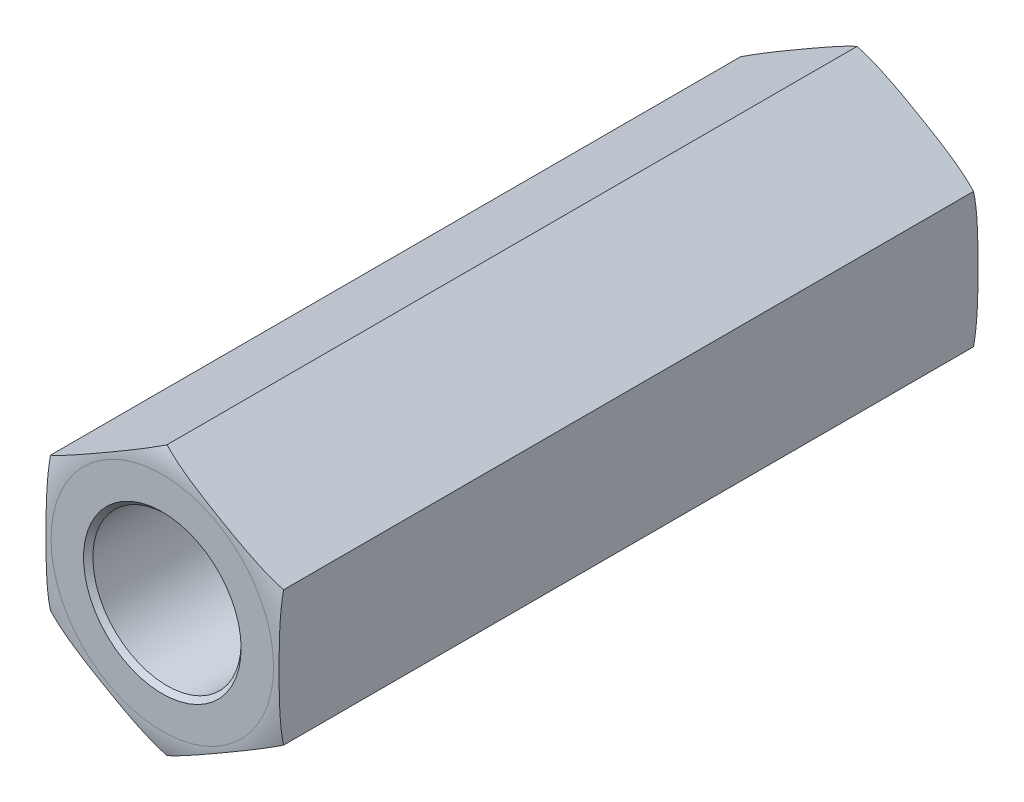
ISO-10303-21;
HEADER;
FILE_DESCRIPTION(('STEP AP214'),'2;1');
FILE_NAME('part.step','',(''),(''),'','','');
FILE_SCHEMA(('AUTOMOTIVE_DESIGN { 1 0 10303 214 1 1 1 1 }'));
ENDSEC;
DATA;
#1=APPLICATION_CONTEXT('core data for automotive mechanical design processes');
#2=APPLICATION_PROTOCOL_DEFINITION('international standard','automotive_design',2000,#1);
#3=PRODUCT_CONTEXT('',#1,'mechanical');
#4=PRODUCT('Part','Part','',(#3));
#5=PRODUCT_RELATED_PRODUCT_CATEGORY('part','',(#4));
#6=PRODUCT_DEFINITION_FORMATION('','',#4);
#7=PRODUCT_DEFINITION_CONTEXT('part definition',#1,'design');
#8=PRODUCT_DEFINITION('design','',#6,#7);
#9=PRODUCT_DEFINITION_SHAPE('','',#8);
#10=(LENGTH_UNIT() NAMED_UNIT(*) SI_UNIT(.MILLI.,.METRE.));
#11=(NAMED_UNIT(*) PLANE_ANGLE_UNIT() SI_UNIT($,.RADIAN.));
#12=(NAMED_UNIT(*) SI_UNIT($,.STERADIAN.) SOLID_ANGLE_UNIT());
#13=UNCERTAINTY_MEASURE_WITH_UNIT(LENGTH_MEASURE(1.E-05),#10,'distance_accuracy_value','');
#14=(GEOMETRIC_REPRESENTATION_CONTEXT(3) GLOBAL_UNCERTAINTY_ASSIGNED_CONTEXT((#13)) GLOBAL_UNIT_ASSIGNED_CONTEXT((#10,
#11,#12)) REPRESENTATION_CONTEXT('',''));
#15=CARTESIAN_POINT('',(0.,0.,0.));
#16=DIRECTION('',(0.,0.,1.));
#17=DIRECTION('',(1.,0.,0.));
#18=AXIS2_PLACEMENT_3D('',#15,#16,#17);
#19=CARTESIAN_POINT('',(0.,-3.66617420935413,9.525));
#20=DIRECTION('',(-0.5,0.866025403784439,0.));
#21=DIRECTION('',(-0.866025403784439,-0.5,0.));
#22=AXIS2_PLACEMENT_3D('',#19,#20,#21);
#23=PLANE('',#22);
#24=CARTESIAN_POINT('',(3.175,-1.83308710467706,-9.398));
#25=CARTESIAN_POINT('',(3.10884502143944,-1.87128169935724,-9.41390141489969));
#26=CARTESIAN_POINT('',(3.04231434139612,-1.90969320538961,-9.4274886076105));
#27=CARTESIAN_POINT('',(2.90881203820564,-1.98677079607408,-9.45081619794021));
#28=CARTESIAN_POINT('',(2.8418409298126,-2.02543658353272,-9.46056047713974));
#29=CARTESIAN_POINT('',(2.70776562760761,-2.10284499535246,-9.4769966530451));
#30=CARTESIAN_POINT('',(2.6406619569018,-2.14158731769806,-9.48369453286691));
#31=CARTESIAN_POINT('',(2.506296989443,-2.21916296783006,-9.4947767572932));
#32=CARTESIAN_POINT('',(2.43903565365471,-2.25799631815348,-9.49916045047396));
#33=CARTESIAN_POINT('',(2.30441315431188,-2.33572065438805,-9.50624030042628));
#34=CARTESIAN_POINT('',(2.23705195613841,-2.37461166028644,-9.50893552375912));
#35=CARTESIAN_POINT('',(2.10230150749303,-2.45240986808527,-9.51315319837134));
#36=CARTESIAN_POINT('',(2.03491225611042,-2.49131707051151,-9.51467560802717));
#37=CARTESIAN_POINT('',(1.90080117716411,-2.56874613804247,-9.51692270588903));
#38=CARTESIAN_POINT('',(1.83407943898347,-2.60726795154186,-9.51765524681808));
#39=CARTESIAN_POINT('',(1.70063258160857,-2.68431353056977,-9.51857673025741));
#40=CARTESIAN_POINT('',(1.63390746238221,-2.72283729611682,-9.5187656658949));
#41=CARTESIAN_POINT('',(1.50042805184615,-2.79990166972109,-9.51866599668056));
#42=CARTESIAN_POINT('',(1.43367376064956,-2.838442277713,-9.51837718117656));
#43=CARTESIAN_POINT('',(1.30016736153918,-2.91552223317792,-9.517221986219));
#44=CARTESIAN_POINT('',(1.23341525368108,-2.95406158061876,-9.51635559703857));
#45=CARTESIAN_POINT('',(1.09992603365712,-3.03113161773351,-9.51378619406563));
#46=CARTESIAN_POINT('',(1.03318892086051,-3.06966230777157,-9.51208322716165));
#47=CARTESIAN_POINT('',(0.899747408901568,-3.14670480062214,-9.5074387229726));
#48=CARTESIAN_POINT('',(0.83304300828058,-3.1852166042768,-9.5044972471358));
#49=CARTESIAN_POINT('',(0.723572811888899,-3.24841925163177,-9.49821741247488));
#50=CARTESIAN_POINT('',(0.680784975201788,-3.27312282066112,-9.49539801104632));
#51=CARTESIAN_POINT('',(0.595275288478836,-3.32249186130894,-9.48886967943036));
#52=CARTESIAN_POINT('',(0.552553419802716,-3.34715734368938,-9.4851610809139));
#53=CARTESIAN_POINT('',(0.467204135573515,-3.39643377591425,-9.47668027114969));
#54=CARTESIAN_POINT('',(0.424576690233944,-3.42104474295592,-9.47190846570084));
#55=CARTESIAN_POINT('',(0.339332728524412,-3.47026036719571,-9.46109877125159));
#56=CARTESIAN_POINT('',(0.296716508711445,-3.49486485317657,-9.45505773130842));
#57=CARTESIAN_POINT('',(0.211632627284932,-3.54398805502186,-9.44151383541612));
#58=CARTESIAN_POINT('',(0.169165057524195,-3.56850671785505,-9.43401019780296));
#59=CARTESIAN_POINT('',(0.0844105764825441,-3.61743974029948,-9.41732035070844));
#60=CARTESIAN_POINT('',(0.0421240573590994,-3.64185387349849,-9.40813149780328));
#61=CARTESIAN_POINT('',(0.,-3.66617420935412,-9.398));
#62=B_SPLINE_CURVE_WITH_KNOTS('',3,(#24,#25,#26,#27,#28,#29,#30,#31,#32,#33,#34,#35,#36,#37,#38,
#39,#40,#41,#42,#43,#44,#45,#46,#47,#48,#49,#50,#51,#52,#53,#54,#55,#56,#57,#58,#59,#60,#61),
.UNSPECIFIED.,.F.,.F.,(4,2,2,2,2,2,2,2,2,2,2,2,2,2,2,2,2,2,4),(0.,0.233977307817948,
0.467717675040706,0.700996973557518,0.934341903229774,1.16781571967243,1.40129782179828,
1.63243665809674,1.86357841666622,2.094822118463,2.32606971471501,2.55730435147404,
2.7885275169442,2.93698369265093,3.08538458004479,3.23372892334588,3.38244598546615,
3.53124274626086,3.68027493713585),.UNSPECIFIED.);
#63=CARTESIAN_POINT('',(3.175,-1.83308710467706,-9.39799999999999));
#64=VERTEX_POINT('',#63);
#65=CARTESIAN_POINT('',(0.,-3.66617420935413,-9.398));
#66=VERTEX_POINT('',#65);
#67=EDGE_CURVE('E99',#64,#66,#62,.T.);
#68=ORIENTED_EDGE('',*,*,#67,.F.);
#69=DIRECTION('',(0.,0.,1.));
#70=VECTOR('',#69,1.);
#71=CARTESIAN_POINT('',(3.175,-1.83308710467706,9.525));
#72=LINE('',#71,#70);
#73=CARTESIAN_POINT('',(3.175,-1.83308710467706,9.398));
#74=VERTEX_POINT('',#73);
#75=EDGE_CURVE('E106',#64,#74,#72,.T.);
#76=ORIENTED_EDGE('',*,*,#75,.T.);
#77=CARTESIAN_POINT('',(0.,-3.66617420935413,9.398));
#78=CARTESIAN_POINT('',(0.0661549785605615,-3.62797961467395,9.41390141489968));
#79=CARTESIAN_POINT('',(0.13268565860388,-3.58956810864157,9.4274886076105));
#80=CARTESIAN_POINT('',(0.266187961794368,-3.51249051795711,9.45081619794021));
#81=CARTESIAN_POINT('',(0.333159070187402,-3.47382473049846,9.46056047713974));
#82=CARTESIAN_POINT('',(0.467234372392397,-3.39641631867873,9.4769966530451));
#83=CARTESIAN_POINT('',(0.534338043098203,-3.35767399633312,9.48369453286691));
#84=CARTESIAN_POINT('',(0.668703010557004,-3.28009834620112,9.4947767572932));
#85=CARTESIAN_POINT('',(0.735964346345294,-3.2412649958777,9.49916045047396));
#86=CARTESIAN_POINT('',(0.870586845688128,-3.16354065964314,9.50624030042628));
#87=CARTESIAN_POINT('',(0.937948043861601,-3.12464965374475,9.50893552375912));
#88=CARTESIAN_POINT('',(1.07269849250698,-3.04685144594591,9.51315319837134));
#89=CARTESIAN_POINT('',(1.14008774388959,-3.00794424351968,9.51467560802717));
#90=CARTESIAN_POINT('',(1.2741988228359,-2.93051517598871,9.51692270588903));
#91=CARTESIAN_POINT('',(1.34092056101654,-2.89199336248932,9.51765524681808));
#92=CARTESIAN_POINT('',(1.47436741839144,-2.81494778346141,9.51857673025741));
#93=CARTESIAN_POINT('',(1.5410925376178,-2.77642401791437,9.5187656658949));
#94=CARTESIAN_POINT('',(1.67457194815386,-2.6993596443101,9.51866599668056));
#95=CARTESIAN_POINT('',(1.74132623935045,-2.66081903631818,9.51837718117656));
#96=CARTESIAN_POINT('',(1.87483263846084,-2.58373908085327,9.517221986219));
#97=CARTESIAN_POINT('',(1.94158474631893,-2.54519973341242,9.51635559703857));
#98=CARTESIAN_POINT('',(2.07507396634289,-2.46812969629767,9.51378619406563));
#99=CARTESIAN_POINT('',(2.1418110791395,-2.42959900625961,9.51208322716165));
#100=CARTESIAN_POINT('',(2.27525259109844,-2.35255651340905,9.5074387229726));
#101=CARTESIAN_POINT('',(2.34195699171943,-2.31404470975438,9.5044972471358));
#102=CARTESIAN_POINT('',(2.45142718811111,-2.25084206239941,9.49821741247488));
#103=CARTESIAN_POINT('',(2.49421502479822,-2.22613849337006,9.49539801104632));
#104=CARTESIAN_POINT('',(2.57972471152117,-2.17676945272225,9.48886967943036));
#105=CARTESIAN_POINT('',(2.62244658019729,-2.15210397034181,9.4851610809139));
#106=CARTESIAN_POINT('',(2.70779586442649,-2.10282753811693,9.47668027114969));
#107=CARTESIAN_POINT('',(2.75042330976606,-2.07821657107527,9.47190846570084));
#108=CARTESIAN_POINT('',(2.83566727147559,-2.02900094683548,9.46109877125159));
#109=CARTESIAN_POINT('',(2.87828349128856,-2.00439646085462,9.45505773130842));
#110=CARTESIAN_POINT('',(2.96336737271507,-1.95527325900932,9.44151383541612));
#111=CARTESIAN_POINT('',(3.00583494247581,-1.93075459617613,9.43401019780296));
#112=CARTESIAN_POINT('',(3.09058942351746,-1.88182157373171,9.41732035070844));
#113=CARTESIAN_POINT('',(3.1328759426409,-1.8574074405327,9.40813149780329));
#114=CARTESIAN_POINT('',(3.175,-1.83308710467706,9.398));
#115=B_SPLINE_CURVE_WITH_KNOTS('',3,(#77,#78,#79,#80,#81,#82,#83,#84,#85,#86,#87,#88,#89,#90,
#91,#92,#93,#94,#95,#96,#97,#98,#99,#100,#101,#102,#103,#104,#105,#106,#107,#108,#109,#110,#111,
#112,#113,#114),.UNSPECIFIED.,.F.,.F.,(4,2,2,2,2,2,2,2,2,2,2,2,2,2,2,2,2,2,4),(0.,
0.233977307817948,0.467717675040707,0.700996973557521,0.934341903229778,1.16781571967243,
1.40129782179829,1.63243665809674,1.86357841666622,2.094822118463,2.32606971471502,
2.55730435147405,2.78852751694421,2.93698369265094,3.08538458004479,3.23372892334589,
3.38244598546615,3.53124274626085,3.68027493713585),.UNSPECIFIED.);
#116=CARTESIAN_POINT('',(0.,-3.66617420935413,9.398));
#117=VERTEX_POINT('',#116);
#118=EDGE_CURVE('E95',#117,#74,#115,.T.);
#119=ORIENTED_EDGE('',*,*,#118,.F.);
#120=DIRECTION('',(0.,0.,1.));
#121=VECTOR('',#120,1.);
#122=CARTESIAN_POINT('',(0.,-3.66617420935413,9.525));
#123=LINE('',#122,#121);
#124=EDGE_CURVE('E148',#117,#66,#123,.F.);
#125=ORIENTED_EDGE('',*,*,#124,.T.);
#126=EDGE_LOOP('',(#68,#76,#119,#125));
#127=FACE_BOUND('',#126,.T.);
#128=ADVANCED_FACE('F16',(#127),#23,.F.);
#129=CARTESIAN_POINT('',(-3.175,-1.83308710467706,9.525));
#130=DIRECTION('',(0.5,0.866025403784439,0.));
#131=DIRECTION('',(-0.866025403784439,0.5,0.));
#132=AXIS2_PLACEMENT_3D('',#129,#130,#131);
#133=PLANE('',#132);
#134=CARTESIAN_POINT('',(0.,-3.66617420935412,-9.398));
#135=CARTESIAN_POINT('',(-0.0661549785605632,-3.62797961467395,-9.41390141489968));
#136=CARTESIAN_POINT('',(-0.132685658603882,-3.58956810864157,-9.4274886076105));
#137=CARTESIAN_POINT('',(-0.26618796179437,-3.51249051795711,-9.45081619794021));
#138=CARTESIAN_POINT('',(-0.333159070187403,-3.47382473049846,-9.46056047713974));
#139=CARTESIAN_POINT('',(-0.467234372392398,-3.39641631867873,-9.4769966530451));
#140=CARTESIAN_POINT('',(-0.534338043098204,-3.35767399633312,-9.48369453286691));
#141=CARTESIAN_POINT('',(-0.668703010557005,-3.28009834620113,-9.4947767572932));
#142=CARTESIAN_POINT('',(-0.735964346345294,-3.2412649958777,-9.49916045047396));
#143=CARTESIAN_POINT('',(-0.870586845688129,-3.16354065964314,-9.50624030042628));
#144=CARTESIAN_POINT('',(-0.937948043861602,-3.12464965374475,-9.50893552375912));
#145=CARTESIAN_POINT('',(-1.07269849250698,-3.04685144594591,-9.51315319837134));
#146=CARTESIAN_POINT('',(-1.14008774388959,-3.00794424351968,-9.51467560802717));
#147=CARTESIAN_POINT('',(-1.2741988228359,-2.93051517598871,-9.51692270588903));
#148=CARTESIAN_POINT('',(-1.34092056101654,-2.89199336248932,-9.51765524681808));
#149=CARTESIAN_POINT('',(-1.47436741839144,-2.81494778346141,-9.51857673025741));
#150=CARTESIAN_POINT('',(-1.5410925376178,-2.77642401791437,-9.5187656658949));
#151=CARTESIAN_POINT('',(-1.67457194815386,-2.6993596443101,-9.51866599668056));
#152=CARTESIAN_POINT('',(-1.74132623935045,-2.66081903631818,-9.51837718117656));
#153=CARTESIAN_POINT('',(-1.87483263846083,-2.58373908085327,-9.517221986219));
#154=CARTESIAN_POINT('',(-1.94158474631893,-2.54519973341242,-9.51635559703857));
#155=CARTESIAN_POINT('',(-2.07507396634289,-2.46812969629767,-9.51378619406563));
#156=CARTESIAN_POINT('',(-2.1418110791395,-2.42959900625961,-9.51208322716165));
#157=CARTESIAN_POINT('',(-2.27525259109844,-2.35255651340905,-9.5074387229726));
#158=CARTESIAN_POINT('',(-2.34195699171943,-2.31404470975439,-9.5044972471358));
#159=CARTESIAN_POINT('',(-2.45142718811111,-2.25084206239941,-9.49821741247488));
#160=CARTESIAN_POINT('',(-2.49421502479822,-2.22613849337006,-9.49539801104632));
#161=CARTESIAN_POINT('',(-2.57972471152117,-2.17676945272225,-9.48886967943036));
#162=CARTESIAN_POINT('',(-2.62244658019729,-2.1521039703418,-9.4851610809139));
#163=CARTESIAN_POINT('',(-2.70779586442649,-2.10282753811693,-9.47668027114969));
#164=CARTESIAN_POINT('',(-2.75042330976606,-2.07821657107527,-9.47190846570084));
#165=CARTESIAN_POINT('',(-2.83566727147559,-2.02900094683548,-9.46109877125159));
#166=CARTESIAN_POINT('',(-2.87828349128856,-2.00439646085462,-9.45505773130842));
#167=CARTESIAN_POINT('',(-2.96336737271507,-1.95527325900932,-9.44151383541612));
#168=CARTESIAN_POINT('',(-3.00583494247581,-1.93075459617613,-9.43401019780296));
#169=CARTESIAN_POINT('',(-3.09058942351746,-1.88182157373171,-9.41732035070844));
#170=CARTESIAN_POINT('',(-3.1328759426409,-1.8574074405327,-9.40813149780329));
#171=CARTESIAN_POINT('',(-3.175,-1.83308710467706,-9.398));
#172=B_SPLINE_CURVE_WITH_KNOTS('',3,(#134,#135,#136,#137,#138,#139,#140,#141,#142,#143,#144,
#145,#146,#147,#148,#149,#150,#151,#152,#153,#154,#155,#156,#157,#158,#159,#160,#161,#162,#163,
#164,#165,#166,#167,#168,#169,#170,#171),.UNSPECIFIED.,.F.,.F.,(4,2,2,2,2,2,2,2,2,2,2,2,2,2,2,2,
2,2,4),(0.,0.233977307817948,0.467717675040707,0.70099697355752,0.934341903229777,
1.16781571967243,1.40129782179829,1.63243665809674,1.86357841666622,2.094822118463,
2.32606971471502,2.55730435147405,2.78852751694421,2.93698369265094,3.08538458004479,
3.23372892334589,3.38244598546615,3.53124274626085,3.68027493713585),.UNSPECIFIED.);
#173=CARTESIAN_POINT('',(-3.175,-1.83308710467706,-9.398));
#174=VERTEX_POINT('',#173);
#175=EDGE_CURVE('E248',#66,#174,#172,.T.);
#176=ORIENTED_EDGE('',*,*,#175,.F.);
#177=ORIENTED_EDGE('',*,*,#124,.F.);
#178=CARTESIAN_POINT('',(-3.175,-1.83308710467706,9.398));
#179=CARTESIAN_POINT('',(-3.10884502143944,-1.87128169935724,9.41390141489968));
#180=CARTESIAN_POINT('',(-3.04231434139612,-1.90969320538961,9.4274886076105));
#181=CARTESIAN_POINT('',(-2.90881203820563,-1.98677079607408,9.45081619794021));
#182=CARTESIAN_POINT('',(-2.8418409298126,-2.02543658353272,9.46056047713974));
#183=CARTESIAN_POINT('',(-2.70776562760761,-2.10284499535246,9.4769966530451));
#184=CARTESIAN_POINT('',(-2.6406619569018,-2.14158731769807,9.48369453286691));
#185=CARTESIAN_POINT('',(-2.506296989443,-2.21916296783006,9.4947767572932));
#186=CARTESIAN_POINT('',(-2.43903565365471,-2.25799631815348,9.49916045047396));
#187=CARTESIAN_POINT('',(-2.30441315431188,-2.33572065438805,9.50624030042628));
#188=CARTESIAN_POINT('',(-2.2370519561384,-2.37461166028644,9.50893552375912));
#189=CARTESIAN_POINT('',(-2.10230150749302,-2.45240986808527,9.51315319837134));
#190=CARTESIAN_POINT('',(-2.03491225611041,-2.49131707051151,9.51467560802717));
#191=CARTESIAN_POINT('',(-1.9008011771641,-2.56874613804247,9.51692270588903));
#192=CARTESIAN_POINT('',(-1.83407943898347,-2.60726795154186,9.51765524681808));
#193=CARTESIAN_POINT('',(-1.70063258160856,-2.68431353056977,9.51857673025741));
#194=CARTESIAN_POINT('',(-1.63390746238221,-2.72283729611682,9.5187656658949));
#195=CARTESIAN_POINT('',(-1.50042805184614,-2.79990166972109,9.51866599668056));
#196=CARTESIAN_POINT('',(-1.43367376064956,-2.838442277713,9.51837718117656));
#197=CARTESIAN_POINT('',(-1.30016736153917,-2.91552223317792,9.517221986219));
#198=CARTESIAN_POINT('',(-1.23341525368107,-2.95406158061877,9.51635559703857));
#199=CARTESIAN_POINT('',(-1.09992603365711,-3.03113161773351,9.51378619406563));
#200=CARTESIAN_POINT('',(-1.03318892086051,-3.06966230777157,9.51208322716165));
#201=CARTESIAN_POINT('',(-0.899747408901562,-3.14670480062214,9.5074387229726));
#202=CARTESIAN_POINT('',(-0.833043008280575,-3.1852166042768,9.5044972471358));
#203=CARTESIAN_POINT('',(-0.723572811888893,-3.24841925163178,9.49821741247488));
#204=CARTESIAN_POINT('',(-0.680784975201782,-3.27312282066112,9.49539801104632));
#205=CARTESIAN_POINT('',(-0.595275288478831,-3.32249186130894,9.48886967943036));
#206=CARTESIAN_POINT('',(-0.552553419802711,-3.34715734368938,9.4851610809139));
#207=CARTESIAN_POINT('',(-0.467204135573511,-3.39643377591425,9.47668027114969));
#208=CARTESIAN_POINT('',(-0.42457669023394,-3.42104474295592,9.47190846570084));
#209=CARTESIAN_POINT('',(-0.339332728524408,-3.47026036719571,9.46109877125159));
#210=CARTESIAN_POINT('',(-0.296716508711442,-3.49486485317657,9.45505773130842));
#211=CARTESIAN_POINT('',(-0.21163262728493,-3.54398805502186,9.44151383541612));
#212=CARTESIAN_POINT('',(-0.169165057524193,-3.56850671785505,9.43401019780296));
#213=CARTESIAN_POINT('',(-0.0844105764825422,-3.61743974029948,9.41732035070844));
#214=CARTESIAN_POINT('',(-0.0421240573590975,-3.64185387349849,9.40813149780329));
#215=CARTESIAN_POINT('',(0.,-3.66617420935413,9.398));
#216=B_SPLINE_CURVE_WITH_KNOTS('',3,(#178,#179,#180,#181,#182,#183,#184,#185,#186,#187,#188,
#189,#190,#191,#192,#193,#194,#195,#196,#197,#198,#199,#200,#201,#202,#203,#204,#205,#206,#207,
#208,#209,#210,#211,#212,#213,#214,#215),.UNSPECIFIED.,.F.,.F.,(4,2,2,2,2,2,2,2,2,2,2,2,2,2,2,2,
2,2,4),(0.,0.233977307817948,0.467717675040708,0.700996973557521,0.934341903229777,
1.16781571967243,1.40129782179829,1.63243665809674,1.86357841666622,2.094822118463,
2.32606971471501,2.55730435147405,2.78852751694421,2.93698369265094,3.08538458004479,
3.23372892334589,3.38244598546616,3.53124274626086,3.68027493713585),.UNSPECIFIED.);
#217=CARTESIAN_POINT('',(-3.175,-1.83308710467706,9.398));
#218=VERTEX_POINT('',#217);
#219=EDGE_CURVE('E275',#218,#117,#216,.T.);
#220=ORIENTED_EDGE('',*,*,#219,.F.);
#221=DIRECTION('',(0.,0.,1.));
#222=VECTOR('',#221,1.);
#223=CARTESIAN_POINT('',(-3.175,-1.83308710467706,9.525));
#224=LINE('',#223,#222);
#225=EDGE_CURVE('E145',#218,#174,#224,.F.);
#226=ORIENTED_EDGE('',*,*,#225,.T.);
#227=EDGE_LOOP('',(#176,#177,#220,#226));
#228=FACE_BOUND('',#227,.T.);
#229=ADVANCED_FACE('F266',(#228),#133,.F.);
#230=CARTESIAN_POINT('',(-3.175,1.83308710467706,9.525));
#231=DIRECTION('',(1.,0.,0.));
#232=DIRECTION('',(0.,1.,0.));
#233=AXIS2_PLACEMENT_3D('',#230,#231,#232);
#234=PLANE('',#233);
#235=CARTESIAN_POINT('',(-3.175,-1.83308710467706,-9.398));
#236=CARTESIAN_POINT('',(-3.175,-1.73237579828684,-9.41894001415179));
#237=CARTESIAN_POINT('',(-3.175,-1.63096506893486,-9.43588534953273));
#238=CARTESIAN_POINT('',(-3.175,-1.42767146651469,-9.46349716439842));
#239=CARTESIAN_POINT('',(-3.175,-1.32579191427254,-9.47418756587531));
#240=CARTESIAN_POINT('',(-3.175,-1.12177634709138,-9.49112804080793));
#241=CARTESIAN_POINT('',(-3.175,-1.0196405664338,-9.49738127071887));
#242=CARTESIAN_POINT('',(-3.175,-0.815663681397378,-9.50690280641833));
#243=CARTESIAN_POINT('',(-3.175,-0.713823115514575,-9.5101834044999));
#244=CARTESIAN_POINT('',(-3.175,-0.510018485441652,-9.51494548487028));
#245=CARTESIAN_POINT('',(-3.175,-0.408054390577977,-9.51642541008817));
#246=CARTESIAN_POINT('',(-3.175,-0.204060200337871,-9.51831468183793));
#247=CARTESIAN_POINT('',(-3.175,-0.102030100168935,-9.51872342414921));
#248=CARTESIAN_POINT('',(-3.175,0.102030100168935,-9.51872342414921));
#249=CARTESIAN_POINT('',(-3.175,0.204060200337871,-9.51831468183793));
#250=CARTESIAN_POINT('',(-3.175,0.408054390577978,-9.51642541008817));
#251=CARTESIAN_POINT('',(-3.175,0.510018485441653,-9.51494548487028));
#252=CARTESIAN_POINT('',(-3.175,0.713823115514576,-9.5101834044999));
#253=CARTESIAN_POINT('',(-3.175,0.815663681397379,-9.50690280641833));
#254=CARTESIAN_POINT('',(-3.175,1.0196405664338,-9.49738127071887));
#255=CARTESIAN_POINT('',(-3.175,1.12177634709138,-9.49112804080793));
#256=CARTESIAN_POINT('',(-3.175,1.32579191427254,-9.47418756587531));
#257=CARTESIAN_POINT('',(-3.175,1.4276714665147,-9.46349716439842));
#258=CARTESIAN_POINT('',(-3.175,1.63096506893486,-9.43588534953273));
#259=CARTESIAN_POINT('',(-3.175,1.73237579828684,-9.41894001415179));
#260=CARTESIAN_POINT('',(-3.175,1.83308710467706,-9.398));
#261=B_SPLINE_CURVE_WITH_KNOTS('',3,(#235,#236,#237,#238,#239,#240,#241,#242,#243,#244,#245,
#246,#247,#248,#249,#250,#251,#252,#253,#254,#255,#256,#257,#258,#259,#260),.UNSPECIFIED.,.F.,
.F.,(4,2,2,2,2,2,2,2,2,2,2,2,4),(0.,0.308333242342808,0.615479423308236,0.922406891130011,
1.2280592962085,1.53397581645216,1.84006485747889,2.14615389850562,2.45207041874928,
2.75772282382777,3.06465029164955,3.37179647261498,3.68012971495779),.UNSPECIFIED.);
#262=CARTESIAN_POINT('',(-3.175,1.83308710467706,-9.398));
#263=VERTEX_POINT('',#262);
#264=EDGE_CURVE('E247',#174,#263,#261,.T.);
#265=ORIENTED_EDGE('',*,*,#264,.F.);
#266=ORIENTED_EDGE('',*,*,#225,.F.);
#267=CARTESIAN_POINT('',(-3.175,1.83308710467706,9.398));
#268=CARTESIAN_POINT('',(-3.175,1.73237579828684,9.41894001415179));
#269=CARTESIAN_POINT('',(-3.175,1.63096506893486,9.43588534953273));
#270=CARTESIAN_POINT('',(-3.175,1.4276714665147,9.46349716439842));
#271=CARTESIAN_POINT('',(-3.175,1.32579191427254,9.47418756587531));
#272=CARTESIAN_POINT('',(-3.175,1.12177634709138,9.49112804080793));
#273=CARTESIAN_POINT('',(-3.175,1.0196405664338,9.49738127071887));
#274=CARTESIAN_POINT('',(-3.175,0.815663681397379,9.50690280641833));
#275=CARTESIAN_POINT('',(-3.175,0.713823115514576,9.5101834044999));
#276=CARTESIAN_POINT('',(-3.175,0.510018485441653,9.51494548487028));
#277=CARTESIAN_POINT('',(-3.175,0.408054390577978,9.51642541008817));
#278=CARTESIAN_POINT('',(-3.175,0.204060200337871,9.51831468183793));
#279=CARTESIAN_POINT('',(-3.175,0.102030100168935,9.51872342414921));
#280=CARTESIAN_POINT('',(-3.175,-0.102030100168935,9.51872342414921));
#281=CARTESIAN_POINT('',(-3.175,-0.204060200337871,9.51831468183793));
#282=CARTESIAN_POINT('',(-3.175,-0.408054390577977,9.51642541008817));
#283=CARTESIAN_POINT('',(-3.175,-0.510018485441652,9.51494548487028));
#284=CARTESIAN_POINT('',(-3.175,-0.713823115514574,9.5101834044999));
#285=CARTESIAN_POINT('',(-3.175,-0.815663681397377,9.50690280641833));
#286=CARTESIAN_POINT('',(-3.175,-1.0196405664338,9.49738127071887));
#287=CARTESIAN_POINT('',(-3.175,-1.12177634709138,9.49112804080793));
#288=CARTESIAN_POINT('',(-3.175,-1.32579191427254,9.47418756587531));
#289=CARTESIAN_POINT('',(-3.175,-1.42767146651469,9.46349716439842));
#290=CARTESIAN_POINT('',(-3.175,-1.63096506893486,9.43588534953273));
#291=CARTESIAN_POINT('',(-3.175,-1.73237579828683,9.41894001415179));
#292=CARTESIAN_POINT('',(-3.175,-1.83308710467706,9.398));
#293=B_SPLINE_CURVE_WITH_KNOTS('',3,(#267,#268,#269,#270,#271,#272,#273,#274,#275,#276,#277,
#278,#279,#280,#281,#282,#283,#284,#285,#286,#287,#288,#289,#290,#291,#292),.UNSPECIFIED.,.F.,
.F.,(4,2,2,2,2,2,2,2,2,2,2,2,4),(0.,0.308333242342808,0.615479423308237,0.922406891130012,
1.22805929620851,1.53397581645217,1.84006485747889,2.14615389850562,2.45207041874928,
2.75772282382777,3.06465029164955,3.37179647261498,3.68012971495779),.UNSPECIFIED.);
#294=CARTESIAN_POINT('',(-3.175,1.83308710467706,9.398));
#295=VERTEX_POINT('',#294);
#296=EDGE_CURVE('E111',#295,#218,#293,.T.);
#297=ORIENTED_EDGE('',*,*,#296,.F.);
#298=DIRECTION('',(0.,0.,1.));
#299=VECTOR('',#298,1.);
#300=CARTESIAN_POINT('',(-3.175,1.83308710467706,9.525));
#301=LINE('',#300,#299);
#302=EDGE_CURVE('E142',#295,#263,#301,.F.);
#303=ORIENTED_EDGE('',*,*,#302,.T.);
#304=EDGE_LOOP('',(#265,#266,#297,#303));
#305=FACE_BOUND('',#304,.T.);
#306=ADVANCED_FACE('F261',(#305),#234,.F.);
#307=CARTESIAN_POINT('',(0.,3.66617420935413,9.525));
#308=DIRECTION('',(0.5,-0.866025403784439,0.));
#309=DIRECTION('',(0.866025403784439,0.5,0.));
#310=AXIS2_PLACEMENT_3D('',#307,#308,#309);
#311=PLANE('',#310);
#312=CARTESIAN_POINT('',(-3.175,1.83308710467706,-9.398));
#313=CARTESIAN_POINT('',(-3.10884502143944,1.87128169935724,-9.41390141489969));
#314=CARTESIAN_POINT('',(-3.04231434139612,1.90969320538962,-9.4274886076105));
#315=CARTESIAN_POINT('',(-2.90881203820563,1.98677079607408,-9.45081619794021));
#316=CARTESIAN_POINT('',(-2.84184092981259,2.02543658353273,-9.46056047713974));
#317=CARTESIAN_POINT('',(-2.7077656276076,2.10284499535246,-9.4769966530451));
#318=CARTESIAN_POINT('',(-2.64066195690179,2.14158731769807,-9.48369453286691));
#319=CARTESIAN_POINT('',(-2.50629698944299,2.21916296783006,-9.4947767572932));
#320=CARTESIAN_POINT('',(-2.4390356536547,2.25799631815349,-9.49916045047396));
#321=CARTESIAN_POINT('',(-2.30441315431187,2.33572065438805,-9.50624030042628));
#322=CARTESIAN_POINT('',(-2.23705195613839,2.37461166028644,-9.50893552375912));
#323=CARTESIAN_POINT('',(-2.10230150749301,2.45240986808528,-9.51315319837134));
#324=CARTESIAN_POINT('',(-2.0349122561104,2.49131707051151,-9.51467560802717));
#325=CARTESIAN_POINT('',(-1.90080117716409,2.56874613804248,-9.51692270588904));
#326=CARTESIAN_POINT('',(-1.83407943898346,2.60726795154187,-9.51765524681809));
#327=CARTESIAN_POINT('',(-1.70063258160855,2.68431353056978,-9.51857673025742));
#328=CARTESIAN_POINT('',(-1.6339074623822,2.72283729611682,-9.5187656658949));
#329=CARTESIAN_POINT('',(-1.50042805184613,2.7999016697211,-9.51866599668056));
#330=CARTESIAN_POINT('',(-1.43367376064954,2.83844227771301,-9.51837718117656));
#331=CARTESIAN_POINT('',(-1.30016736153916,2.91552223317793,-9.517221986219));
#332=CARTESIAN_POINT('',(-1.23341525368106,2.95406158061877,-9.51635559703857));
#333=CARTESIAN_POINT('',(-1.0999260336571,3.03113161773352,-9.51378619406563));
#334=CARTESIAN_POINT('',(-1.03318892086049,3.06966230777158,-9.51208322716165));
#335=CARTESIAN_POINT('',(-0.899747408901546,3.14670480062215,-9.5074387229726));
#336=CARTESIAN_POINT('',(-0.833043008280558,3.18521660427681,-9.5044972471358));
#337=CARTESIAN_POINT('',(-0.723572811888877,3.24841925163179,-9.49821741247488));
#338=CARTESIAN_POINT('',(-0.680784975201767,3.27312282066113,-9.49539801104632));
#339=CARTESIAN_POINT('',(-0.595275288478818,3.32249186130895,-9.48886967943036));
#340=CARTESIAN_POINT('',(-0.552553419802699,3.34715734368939,-9.4851610809139));
#341=CARTESIAN_POINT('',(-0.4672041355735,3.39643377591426,-9.47668027114969));
#342=CARTESIAN_POINT('',(-0.42457669023393,3.42104474295592,-9.47190846570084));
#343=CARTESIAN_POINT('',(-0.339332728524399,3.47026036719571,-9.46109877125159));
#344=CARTESIAN_POINT('',(-0.296716508711434,3.49486485317657,-9.45505773130842));
#345=CARTESIAN_POINT('',(-0.211632627284923,3.54398805502187,-9.44151383541612));
#346=CARTESIAN_POINT('',(-0.169165057524187,3.56850671785506,-9.43401019780296));
#347=CARTESIAN_POINT('',(-0.0844105764825377,3.61743974029948,-9.41732035070844));
#348=CARTESIAN_POINT('',(-0.0421240573590937,3.64185387349849,-9.40813149780328));
#349=CARTESIAN_POINT('',(0.,3.66617420935413,-9.398));
#350=B_SPLINE_CURVE_WITH_KNOTS('',3,(#312,#313,#314,#315,#316,#317,#318,#319,#320,#321,#322,
#323,#324,#325,#326,#327,#328,#329,#330,#331,#332,#333,#334,#335,#336,#337,#338,#339,#340,#341,
#342,#343,#344,#345,#346,#347,#348,#349),.UNSPECIFIED.,.F.,.F.,(4,2,2,2,2,2,2,2,2,2,2,2,2,2,2,2,
2,2,4),(0.,0.23397730781795,0.46771767504071,0.700996973557523,0.934341903229781,
1.16781571967244,1.40129782179829,1.63243665809675,1.86357841666623,2.09482211846301,
2.32606971471503,2.55730435147406,2.78852751694422,2.93698369265095,3.0853845800448,
3.2337289233459,3.38244598546616,3.53124274626086,3.68027493713585),.UNSPECIFIED.);
#351=CARTESIAN_POINT('',(0.,3.66617420935413,-9.398));
#352=VERTEX_POINT('',#351);
#353=EDGE_CURVE('E246',#263,#352,#350,.T.);
#354=ORIENTED_EDGE('',*,*,#353,.F.);
#355=ORIENTED_EDGE('',*,*,#302,.F.);
#356=CARTESIAN_POINT('',(0.,3.66617420935413,9.398));
#357=CARTESIAN_POINT('',(-0.0661549785605592,3.62797961467395,9.41390141489969));
#358=CARTESIAN_POINT('',(-0.132685658603878,3.58956810864157,9.4274886076105));
#359=CARTESIAN_POINT('',(-0.266187961794366,3.51249051795711,9.45081619794021));
#360=CARTESIAN_POINT('',(-0.333159070187399,3.47382473049846,9.46056047713974));
#361=CARTESIAN_POINT('',(-0.467234372392394,3.39641631867873,9.4769966530451));
#362=CARTESIAN_POINT('',(-0.534338043098199,3.35767399633312,9.48369453286691));
#363=CARTESIAN_POINT('',(-0.668703010557,3.28009834620113,9.4947767572932));
#364=CARTESIAN_POINT('',(-0.73596434634529,3.2412649958777,9.49916045047396));
#365=CARTESIAN_POINT('',(-0.870586845688124,3.16354065964314,9.50624030042628));
#366=CARTESIAN_POINT('',(-0.937948043861597,3.12464965374475,9.50893552375912));
#367=CARTESIAN_POINT('',(-1.07269849250698,3.04685144594592,9.51315319837134));
#368=CARTESIAN_POINT('',(-1.14008774388959,3.00794424351968,9.51467560802717));
#369=CARTESIAN_POINT('',(-1.2741988228359,2.93051517598871,9.51692270588903));
#370=CARTESIAN_POINT('',(-1.34092056101653,2.89199336248933,9.51765524681808));
#371=CARTESIAN_POINT('',(-1.47436741839144,2.81494778346141,9.51857673025741));
#372=CARTESIAN_POINT('',(-1.54109253761779,2.77642401791437,9.5187656658949));
#373=CARTESIAN_POINT('',(-1.67457194815386,2.6993596443101,9.51866599668056));
#374=CARTESIAN_POINT('',(-1.74132623935044,2.66081903631819,9.51837718117656));
#375=CARTESIAN_POINT('',(-1.87483263846083,2.58373908085327,9.517221986219));
#376=CARTESIAN_POINT('',(-1.94158474631892,2.54519973341242,9.51635559703857));
#377=CARTESIAN_POINT('',(-2.07507396634289,2.46812969629767,9.51378619406563));
#378=CARTESIAN_POINT('',(-2.14181107913949,2.42959900625962,9.51208322716165));
#379=CARTESIAN_POINT('',(-2.27525259109844,2.35255651340905,9.5074387229726));
#380=CARTESIAN_POINT('',(-2.34195699171942,2.31404470975439,9.5044972471358));
#381=CARTESIAN_POINT('',(-2.4514271881111,2.25084206239941,9.49821741247488));
#382=CARTESIAN_POINT('',(-2.49421502479822,2.22613849337006,9.49539801104632));
#383=CARTESIAN_POINT('',(-2.57972471152117,2.17676945272225,9.48886967943036));
#384=CARTESIAN_POINT('',(-2.62244658019729,2.15210397034181,9.4851610809139));
#385=CARTESIAN_POINT('',(-2.70779586442649,2.10282753811694,9.47668027114969));
#386=CARTESIAN_POINT('',(-2.75042330976606,2.07821657107527,9.47190846570084));
#387=CARTESIAN_POINT('',(-2.83566727147559,2.02900094683548,9.46109877125159));
#388=CARTESIAN_POINT('',(-2.87828349128856,2.00439646085462,9.45505773130842));
#389=CARTESIAN_POINT('',(-2.96336737271507,1.95527325900932,9.44151383541612));
#390=CARTESIAN_POINT('',(-3.0058349424758,1.93075459617613,9.43401019780296));
#391=CARTESIAN_POINT('',(-3.09058942351746,1.88182157373171,9.41732035070844));
#392=CARTESIAN_POINT('',(-3.1328759426409,1.8574074405327,9.40813149780328));
#393=CARTESIAN_POINT('',(-3.175,1.83308710467706,9.398));
#394=B_SPLINE_CURVE_WITH_KNOTS('',3,(#356,#357,#358,#359,#360,#361,#362,#363,#364,#365,#366,
#367,#368,#369,#370,#371,#372,#373,#374,#375,#376,#377,#378,#379,#380,#381,#382,#383,#384,#385,
#386,#387,#388,#389,#390,#391,#392,#393),.UNSPECIFIED.,.F.,.F.,(4,2,2,2,2,2,2,2,2,2,2,2,2,2,2,2,
2,2,4),(0.,0.233977307817948,0.467717675040706,0.700996973557519,0.934341903229776,
1.16781571967243,1.40129782179828,1.63243665809674,1.86357841666622,2.094822118463,
2.32606971471501,2.55730435147405,2.78852751694421,2.93698369265094,3.08538458004479,
3.23372892334588,3.38244598546615,3.53124274626085,3.68027493713585),.UNSPECIFIED.);
#395=CARTESIAN_POINT('',(0.,3.66617420935413,9.398));
#396=VERTEX_POINT('',#395);
#397=EDGE_CURVE('E109',#396,#295,#394,.T.);
#398=ORIENTED_EDGE('',*,*,#397,.F.);
#399=DIRECTION('',(0.,0.,1.));
#400=VECTOR('',#399,1.);
#401=CARTESIAN_POINT('',(0.,3.66617420935413,9.525));
#402=LINE('',#401,#400);
#403=EDGE_CURVE('E82',#396,#352,#402,.F.);
#404=ORIENTED_EDGE('',*,*,#403,.T.);
#405=EDGE_LOOP('',(#354,#355,#398,#404));
#406=FACE_BOUND('',#405,.T.);
#407=ADVANCED_FACE('F258',(#406),#311,.F.);
#408=CARTESIAN_POINT('',(3.175,1.83308710467706,9.525));
#409=DIRECTION('',(-0.5,-0.866025403784438,0.));
#410=DIRECTION('',(0.866025403784438,-0.5,0.));
#411=AXIS2_PLACEMENT_3D('',#408,#409,#410);
#412=PLANE('',#411);
#413=CARTESIAN_POINT('',(0.,3.66617420935413,-9.398));
#414=CARTESIAN_POINT('',(0.0661549785605647,3.62797961467395,-9.41390141489968));
#415=CARTESIAN_POINT('',(0.132685658603884,3.58956810864157,-9.4274886076105));
#416=CARTESIAN_POINT('',(0.266187961794371,3.51249051795711,-9.45081619794021));
#417=CARTESIAN_POINT('',(0.333159070187404,3.47382473049846,-9.46056047713974));
#418=CARTESIAN_POINT('',(0.4672343723924,3.39641631867873,-9.4769966530451));
#419=CARTESIAN_POINT('',(0.534338043098205,3.35767399633312,-9.48369453286691));
#420=CARTESIAN_POINT('',(0.668703010557007,3.28009834620112,-9.4947767572932));
#421=CARTESIAN_POINT('',(0.735964346345297,3.2412649958777,-9.49916045047396));
#422=CARTESIAN_POINT('',(0.870586845688131,3.16354065964314,-9.50624030042628));
#423=CARTESIAN_POINT('',(0.937948043861604,3.12464965374475,-9.50893552375912));
#424=CARTESIAN_POINT('',(1.07269849250699,3.04685144594591,-9.51315319837134));
#425=CARTESIAN_POINT('',(1.14008774388959,3.00794424351968,-9.51467560802717));
#426=CARTESIAN_POINT('',(1.27419882283591,2.93051517598871,-9.51692270588903));
#427=CARTESIAN_POINT('',(1.34092056101654,2.89199336248932,-9.51765524681808));
#428=CARTESIAN_POINT('',(1.47436741839145,2.81494778346141,-9.51857673025741));
#429=CARTESIAN_POINT('',(1.5410925376178,2.77642401791437,-9.5187656658949));
#430=CARTESIAN_POINT('',(1.67457194815387,2.6993596443101,-9.51866599668056));
#431=CARTESIAN_POINT('',(1.74132623935045,2.66081903631818,-9.51837718117656));
#432=CARTESIAN_POINT('',(1.87483263846084,2.58373908085326,-9.517221986219));
#433=CARTESIAN_POINT('',(1.94158474631893,2.54519973341242,-9.51635559703857));
#434=CARTESIAN_POINT('',(2.0750739663429,2.46812969629767,-9.51378619406563));
#435=CARTESIAN_POINT('',(2.1418110791395,2.42959900625961,-9.51208322716165));
#436=CARTESIAN_POINT('',(2.27525259109845,2.35255651340904,-9.5074387229726));
#437=CARTESIAN_POINT('',(2.34195699171943,2.31404470975438,-9.5044972471358));
#438=CARTESIAN_POINT('',(2.45142718811111,2.25084206239941,-9.49821741247488));
#439=CARTESIAN_POINT('',(2.49421502479823,2.22613849337006,-9.49539801104632));
#440=CARTESIAN_POINT('',(2.57972471152118,2.17676945272224,-9.48886967943036));
#441=CARTESIAN_POINT('',(2.6224465801973,2.1521039703418,-9.4851610809139));
#442=CARTESIAN_POINT('',(2.70779586442649,2.10282753811693,-9.47668027114969));
#443=CARTESIAN_POINT('',(2.75042330976606,2.07821657107527,-9.47190846570084));
#444=CARTESIAN_POINT('',(2.8356672714756,2.02900094683548,-9.46109877125159));
#445=CARTESIAN_POINT('',(2.87828349128856,2.00439646085462,-9.45505773130842));
#446=CARTESIAN_POINT('',(2.96336737271507,1.95527325900932,-9.44151383541612));
#447=CARTESIAN_POINT('',(3.00583494247581,1.93075459617613,-9.43401019780296));
#448=CARTESIAN_POINT('',(3.09058942351746,1.88182157373171,-9.41732035070844));
#449=CARTESIAN_POINT('',(3.1328759426409,1.8574074405327,-9.40813149780329));
#450=CARTESIAN_POINT('',(3.175,1.83308710467706,-9.398));
#451=B_SPLINE_CURVE_WITH_KNOTS('',3,(#413,#414,#415,#416,#417,#418,#419,#420,#421,#422,#423,
#424,#425,#426,#427,#428,#429,#430,#431,#432,#433,#434,#435,#436,#437,#438,#439,#440,#441,#442,
#443,#444,#445,#446,#447,#448,#449,#450),.UNSPECIFIED.,.F.,.F.,(4,2,2,2,2,2,2,2,2,2,2,2,2,2,2,2,
2,2,4),(0.,0.233977307817949,0.467717675040707,0.700996973557521,0.934341903229778,
1.16781571967243,1.40129782179829,1.63243665809674,1.86357841666622,2.094822118463,
2.32606971471502,2.55730435147405,2.78852751694421,2.93698369265094,3.08538458004479,
3.23372892334589,3.38244598546615,3.53124274626085,3.68027493713585),.UNSPECIFIED.);
#452=CARTESIAN_POINT('',(3.175,1.83308710467706,-9.398));
#453=VERTEX_POINT('',#452);
#454=EDGE_CURVE('E163',#352,#453,#451,.T.);
#455=ORIENTED_EDGE('',*,*,#454,.F.);
#456=ORIENTED_EDGE('',*,*,#403,.F.);
#457=CARTESIAN_POINT('',(3.175,1.83308710467706,9.398));
#458=CARTESIAN_POINT('',(3.10884502143944,1.87128169935724,9.41390141489969));
#459=CARTESIAN_POINT('',(3.04231434139612,1.90969320538961,9.4274886076105));
#460=CARTESIAN_POINT('',(2.90881203820563,1.98677079607408,9.45081619794021));
#461=CARTESIAN_POINT('',(2.8418409298126,2.02543658353272,9.46056047713974));
#462=CARTESIAN_POINT('',(2.70776562760761,2.10284499535246,9.4769966530451));
#463=CARTESIAN_POINT('',(2.6406619569018,2.14158731769807,9.48369453286691));
#464=CARTESIAN_POINT('',(2.506296989443,2.21916296783006,9.4947767572932));
#465=CARTESIAN_POINT('',(2.43903565365471,2.25799631815348,9.49916045047396));
#466=CARTESIAN_POINT('',(2.30441315431188,2.33572065438805,9.50624030042628));
#467=CARTESIAN_POINT('',(2.2370519561384,2.37461166028644,9.50893552375912));
#468=CARTESIAN_POINT('',(2.10230150749302,2.45240986808527,9.51315319837134));
#469=CARTESIAN_POINT('',(2.03491225611041,2.49131707051151,9.51467560802717));
#470=CARTESIAN_POINT('',(1.9008011771641,2.56874613804247,9.51692270588903));
#471=CARTESIAN_POINT('',(1.83407943898347,2.60726795154186,9.51765524681808));
#472=CARTESIAN_POINT('',(1.70063258160856,2.68431353056977,9.51857673025741));
#473=CARTESIAN_POINT('',(1.63390746238221,2.72283729611682,9.5187656658949));
#474=CARTESIAN_POINT('',(1.50042805184614,2.79990166972109,9.51866599668056));
#475=CARTESIAN_POINT('',(1.43367376064956,2.838442277713,9.51837718117656));
#476=CARTESIAN_POINT('',(1.30016736153917,2.91552223317792,9.517221986219));
#477=CARTESIAN_POINT('',(1.23341525368107,2.95406158061877,9.51635559703857));
#478=CARTESIAN_POINT('',(1.09992603365711,3.03113161773351,9.51378619406563));
#479=CARTESIAN_POINT('',(1.03318892086051,3.06966230777157,9.51208322716165));
#480=CARTESIAN_POINT('',(0.899747408901563,3.14670480062214,9.5074387229726));
#481=CARTESIAN_POINT('',(0.833043008280576,3.1852166042768,9.5044972471358));
#482=CARTESIAN_POINT('',(0.723572811888894,3.24841925163178,9.49821741247488));
#483=CARTESIAN_POINT('',(0.680784975201783,3.27312282066112,9.49539801104632));
#484=CARTESIAN_POINT('',(0.595275288478832,3.32249186130894,9.48886967943036));
#485=CARTESIAN_POINT('',(0.552553419802713,3.34715734368938,9.4851610809139));
#486=CARTESIAN_POINT('',(0.467204135573513,3.39643377591425,9.47668027114969));
#487=CARTESIAN_POINT('',(0.424576690233942,3.42104474295592,9.47190846570084));
#488=CARTESIAN_POINT('',(0.339332728524411,3.47026036719571,9.46109877125159));
#489=CARTESIAN_POINT('',(0.296716508711444,3.49486485317657,9.45505773130842));
#490=CARTESIAN_POINT('',(0.211632627284932,3.54398805502186,9.44151383541612));
#491=CARTESIAN_POINT('',(0.169165057524196,3.56850671785505,9.43401019780296));
#492=CARTESIAN_POINT('',(0.0844105764825452,3.61743974029948,9.41732035070844));
#493=CARTESIAN_POINT('',(0.0421240573591009,3.64185387349849,9.40813149780328));
#494=CARTESIAN_POINT('',(0.,3.66617420935413,9.398));
#495=B_SPLINE_CURVE_WITH_KNOTS('',3,(#457,#458,#459,#460,#461,#462,#463,#464,#465,#466,#467,
#468,#469,#470,#471,#472,#473,#474,#475,#476,#477,#478,#479,#480,#481,#482,#483,#484,#485,#486,
#487,#488,#489,#490,#491,#492,#493,#494),.UNSPECIFIED.,.F.,.F.,(4,2,2,2,2,2,2,2,2,2,2,2,2,2,2,2,
2,2,4),(0.,0.233977307817948,0.467717675040707,0.700996973557519,0.934341903229777,
1.16781571967243,1.40129782179828,1.63243665809674,1.86357841666622,2.094822118463,
2.32606971471501,2.55730435147405,2.78852751694421,2.93698369265094,3.08538458004479,
3.23372892334589,3.38244598546615,3.53124274626085,3.68027493713585),.UNSPECIFIED.);
#496=CARTESIAN_POINT('',(3.175,1.83308710467706,9.398));
#497=VERTEX_POINT('',#496);
#498=EDGE_CURVE('E91',#497,#396,#495,.T.);
#499=ORIENTED_EDGE('',*,*,#498,.F.);
#500=DIRECTION('',(0.,0.,1.));
#501=VECTOR('',#500,1.);
#502=CARTESIAN_POINT('',(3.175,1.83308710467706,9.525));
#503=LINE('',#502,#501);
#504=EDGE_CURVE('E103',#497,#453,#503,.F.);
#505=ORIENTED_EDGE('',*,*,#504,.T.);
#506=EDGE_LOOP('',(#455,#456,#499,#505));
#507=FACE_BOUND('',#506,.T.);
#508=ADVANCED_FACE('F108',(#507),#412,.F.);
#509=CARTESIAN_POINT('',(3.175,-1.83308710467706,9.525));
#510=DIRECTION('',(-1.,0.,0.));
#511=DIRECTION('',(0.,-1.,0.));
#512=AXIS2_PLACEMENT_3D('',#509,#510,#511);
#513=PLANE('',#512);
#514=ORIENTED_EDGE('',*,*,#75,.F.);
#515=CARTESIAN_POINT('',(3.175,1.83308710467706,-9.398));
#516=CARTESIAN_POINT('',(3.175,1.73237579828683,-9.41894001415179));
#517=CARTESIAN_POINT('',(3.175,1.63096506893486,-9.43588534953273));
#518=CARTESIAN_POINT('',(3.175,1.42767146651469,-9.46349716439842));
#519=CARTESIAN_POINT('',(3.175,1.32579191427254,-9.47418756587531));
#520=CARTESIAN_POINT('',(3.175,1.12177634709138,-9.49112804080793));
#521=CARTESIAN_POINT('',(3.175,1.0196405664338,-9.49738127071887));
#522=CARTESIAN_POINT('',(3.175,0.815663681397377,-9.50690280641833));
#523=CARTESIAN_POINT('',(3.175,0.713823115514574,-9.5101834044999));
#524=CARTESIAN_POINT('',(3.175,0.510018485441652,-9.51494548487028));
#525=CARTESIAN_POINT('',(3.175,0.408054390577977,-9.51642541008817));
#526=CARTESIAN_POINT('',(3.175,0.20406020033787,-9.51831468183793));
#527=CARTESIAN_POINT('',(3.175,0.102030100168935,-9.51872342414921));
#528=CARTESIAN_POINT('',(3.175,-0.102030100168936,-9.51872342414921));
#529=CARTESIAN_POINT('',(3.175,-0.204060200337872,-9.51831468183793));
#530=CARTESIAN_POINT('',(3.175,-0.408054390577979,-9.51642541008817));
#531=CARTESIAN_POINT('',(3.175,-0.510018485441654,-9.51494548487028));
#532=CARTESIAN_POINT('',(3.175,-0.713823115514577,-9.5101834044999));
#533=CARTESIAN_POINT('',(3.175,-0.81566368139738,-9.50690280641833));
#534=CARTESIAN_POINT('',(3.175,-1.0196405664338,-9.49738127071887));
#535=CARTESIAN_POINT('',(3.175,-1.12177634709138,-9.49112804080793));
#536=CARTESIAN_POINT('',(3.175,-1.32579191427255,-9.47418756587531));
#537=CARTESIAN_POINT('',(3.175,-1.4276714665147,-9.46349716439843));
#538=CARTESIAN_POINT('',(3.175,-1.63096506893487,-9.43588534953274));
#539=CARTESIAN_POINT('',(3.175,-1.73237579828684,-9.41894001415179));
#540=CARTESIAN_POINT('',(3.175,-1.83308710467707,-9.398));
#541=B_SPLINE_CURVE_WITH_KNOTS('',3,(#515,#516,#517,#518,#519,#520,#521,#522,#523,#524,#525,
#526,#527,#528,#529,#530,#531,#532,#533,#534,#535,#536,#537,#538,#539,#540),.UNSPECIFIED.,.F.,
.F.,(4,2,2,2,2,2,2,2,2,2,2,2,4),(0.,0.308333242342808,0.615479423308236,0.922406891130011,
1.2280592962085,1.53397581645216,1.84006485747889,2.14615389850562,2.45207041874928,
2.75772282382777,3.06465029164955,3.37179647261498,3.68012971495779),.UNSPECIFIED.);
#542=EDGE_CURVE('E105',#453,#64,#541,.T.);
#543=ORIENTED_EDGE('',*,*,#542,.F.);
#544=ORIENTED_EDGE('',*,*,#504,.F.);
#545=CARTESIAN_POINT('',(3.175,-1.83308710467706,9.398));
#546=CARTESIAN_POINT('',(3.175,-1.73237579828684,9.41894001415179));
#547=CARTESIAN_POINT('',(3.175,-1.63096506893486,9.43588534953273));
#548=CARTESIAN_POINT('',(3.175,-1.42767146651469,9.46349716439842));
#549=CARTESIAN_POINT('',(3.175,-1.32579191427254,9.47418756587531));
#550=CARTESIAN_POINT('',(3.175,-1.12177634709138,9.49112804080793));
#551=CARTESIAN_POINT('',(3.175,-1.0196405664338,9.49738127071887));
#552=CARTESIAN_POINT('',(3.175,-0.815663681397378,9.50690280641833));
#553=CARTESIAN_POINT('',(3.175,-0.713823115514575,9.5101834044999));
#554=CARTESIAN_POINT('',(3.175,-0.510018485441652,9.51494548487028));
#555=CARTESIAN_POINT('',(3.175,-0.408054390577977,9.51642541008817));
#556=CARTESIAN_POINT('',(3.175,-0.204060200337871,9.51831468183793));
#557=CARTESIAN_POINT('',(3.175,-0.102030100168935,9.51872342414921));
#558=CARTESIAN_POINT('',(3.175,0.102030100168936,9.51872342414921));
#559=CARTESIAN_POINT('',(3.175,0.204060200337871,9.51831468183793));
#560=CARTESIAN_POINT('',(3.175,0.408054390577978,9.51642541008817));
#561=CARTESIAN_POINT('',(3.175,0.510018485441652,9.51494548487028));
#562=CARTESIAN_POINT('',(3.175,0.713823115514575,9.5101834044999));
#563=CARTESIAN_POINT('',(3.175,0.815663681397378,9.50690280641833));
#564=CARTESIAN_POINT('',(3.175,1.0196405664338,9.49738127071887));
#565=CARTESIAN_POINT('',(3.175,1.12177634709138,9.49112804080793));
#566=CARTESIAN_POINT('',(3.175,1.32579191427254,9.47418756587531));
#567=CARTESIAN_POINT('',(3.175,1.42767146651469,9.46349716439842));
#568=CARTESIAN_POINT('',(3.175,1.63096506893486,9.43588534953273));
#569=CARTESIAN_POINT('',(3.175,1.73237579828683,9.41894001415179));
#570=CARTESIAN_POINT('',(3.175,1.83308710467706,9.398));
#571=B_SPLINE_CURVE_WITH_KNOTS('',3,(#545,#546,#547,#548,#549,#550,#551,#552,#553,#554,#555,
#556,#557,#558,#559,#560,#561,#562,#563,#564,#565,#566,#567,#568,#569,#570),.UNSPECIFIED.,.F.,
.F.,(4,2,2,2,2,2,2,2,2,2,2,2,4),(0.,0.308333242342808,0.615479423308237,0.922406891130012,
1.2280592962085,1.53397581645216,1.84006485747889,2.14615389850562,2.45207041874928,
2.75772282382777,3.06465029164955,3.37179647261498,3.68012971495778),.UNSPECIFIED.);
#572=EDGE_CURVE('E87',#74,#497,#571,.T.);
#573=ORIENTED_EDGE('',*,*,#572,.F.);
#574=EDGE_LOOP('',(#514,#543,#544,#573));
#575=FACE_BOUND('',#574,.T.);
#576=ADVANCED_FACE('F104',(#575),#513,.F.);
#577=CARTESIAN_POINT('',(0.,0.,7.87400000000001));
#578=DIRECTION('',(0.,0.,-1.));
#579=DIRECTION('',(-1.,0.,0.));
#580=AXIS2_PLACEMENT_3D('',#577,#578,#579);
#581=TOROIDAL_SURFACE('',#580,3.03117420935413,1.65099999999999);
#582=CARTESIAN_POINT('',(0.,0.,9.525));
#583=DIRECTION('',(0.,0.,-1.));
#584=DIRECTION('',(-1.,0.,0.));
#585=AXIS2_PLACEMENT_3D('',#582,#583,#584);
#586=CIRCLE('',#585,3.03117420935413);
#587=CARTESIAN_POINT('',(3.03117420935413,0.,9.525));
#588=VERTEX_POINT('',#587);
#589=CARTESIAN_POINT('',(-3.03117420935413,0.,9.525));
#590=VERTEX_POINT('',#589);
#591=EDGE_CURVE('E162',#588,#590,#586,.F.);
#592=ORIENTED_EDGE('',*,*,#591,.F.);
#593=CARTESIAN_POINT('',(0.,0.,9.525));
#594=DIRECTION('',(0.,0.,-1.));
#595=DIRECTION('',(1.,0.,0.));
#596=AXIS2_PLACEMENT_3D('',#593,#594,#595);
#597=CIRCLE('',#596,3.03117420935413);
#598=EDGE_CURVE('E198',#590,#588,#597,.F.);
#599=ORIENTED_EDGE('',*,*,#598,.F.);
#600=EDGE_LOOP('',(#592,#599));
#601=FACE_BOUND('',#600,.T.);
#602=ORIENTED_EDGE('',*,*,#118,.T.);
#603=ORIENTED_EDGE('',*,*,#572,.T.);
#604=ORIENTED_EDGE('',*,*,#498,.T.);
#605=ORIENTED_EDGE('',*,*,#397,.T.);
#606=ORIENTED_EDGE('',*,*,#296,.T.);
#607=ORIENTED_EDGE('',*,*,#219,.T.);
#608=EDGE_LOOP('',(#602,#603,#604,#605,#606,#607));
#609=FACE_BOUND('',#608,.T.);
#610=ADVANCED_FACE('F89',(#601,#609),#581,.T.);
#611=CARTESIAN_POINT('',(0.,0.,-7.87400000000001));
#612=DIRECTION('',(0.,0.,1.));
#613=DIRECTION('',(-1.,0.,0.));
#614=AXIS2_PLACEMENT_3D('',#611,#612,#613);
#615=TOROIDAL_SURFACE('',#614,3.03117420935413,1.65099999999999);
#616=CARTESIAN_POINT('',(0.,0.,-9.525));
#617=DIRECTION('',(0.,0.,1.));
#618=DIRECTION('',(-1.,0.,0.));
#619=AXIS2_PLACEMENT_3D('',#616,#617,#618);
#620=CIRCLE('',#619,3.03117420935413);
#621=CARTESIAN_POINT('',(-3.03117420935413,0.,-9.525));
#622=VERTEX_POINT('',#621);
#623=CARTESIAN_POINT('',(3.03117420935413,0.,-9.525));
#624=VERTEX_POINT('',#623);
#625=EDGE_CURVE('E201',#622,#624,#620,.T.);
#626=ORIENTED_EDGE('',*,*,#625,.T.);
#627=CARTESIAN_POINT('',(0.,0.,-9.525));
#628=DIRECTION('',(0.,0.,1.));
#629=DIRECTION('',(1.,0.,0.));
#630=AXIS2_PLACEMENT_3D('',#627,#628,#629);
#631=CIRCLE('',#630,3.03117420935413);
#632=EDGE_CURVE('E36',#624,#622,#631,.T.);
#633=ORIENTED_EDGE('',*,*,#632,.T.);
#634=EDGE_LOOP('',(#626,#633));
#635=FACE_BOUND('',#634,.T.);
#636=ORIENTED_EDGE('',*,*,#454,.T.);
#637=ORIENTED_EDGE('',*,*,#542,.T.);
#638=ORIENTED_EDGE('',*,*,#67,.T.);
#639=ORIENTED_EDGE('',*,*,#175,.T.);
#640=ORIENTED_EDGE('',*,*,#264,.T.);
#641=ORIENTED_EDGE('',*,*,#353,.T.);
#642=EDGE_LOOP('',(#636,#637,#638,#639,#640,#641));
#643=FACE_BOUND('',#642,.T.);
#644=ADVANCED_FACE('F168',(#635,#643),#615,.T.);
#645=CARTESIAN_POINT('',(0.,0.,9.525));
#646=DIRECTION('',(0.,0.,1.));
#647=DIRECTION('',(1.,0.,0.));
#648=AXIS2_PLACEMENT_3D('',#645,#646,#647);
#649=PLANE('',#648);
#650=ORIENTED_EDGE('',*,*,#591,.T.);
#651=ORIENTED_EDGE('',*,*,#598,.T.);
#652=EDGE_LOOP('',(#650,#651));
#653=FACE_BOUND('',#652,.T.);
#654=CARTESIAN_POINT('',(0.,0.,9.5250000000533));
#655=DIRECTION('',(0.,0.,1.));
#656=DIRECTION('',(1.,0.,0.));
#657=AXIS2_PLACEMENT_3D('',#654,#655,#656);
#658=CIRCLE('',#657,2.14630000004945);
#659=CARTESIAN_POINT('',(2.14630000004945,0.,9.5250000000533));
#660=VERTEX_POINT('',#659);
#661=EDGE_CURVE('E154',#660,#660,#658,.F.);
#662=ORIENTED_EDGE('',*,*,#661,.T.);
#663=EDGE_LOOP('',(#662));
#664=FACE_BOUND('',#663,.T.);
#665=ADVANCED_FACE('F173',(#653,#664),#649,.T.);
#666=CARTESIAN_POINT('',(0.,0.,-9.525));
#667=DIRECTION('',(0.,0.,1.));
#668=DIRECTION('',(1.,0.,0.));
#669=AXIS2_PLACEMENT_3D('',#666,#667,#668);
#670=PLANE('',#669);
#671=ORIENTED_EDGE('',*,*,#625,.F.);
#672=ORIENTED_EDGE('',*,*,#632,.F.);
#673=EDGE_LOOP('',(#671,#672));
#674=FACE_BOUND('',#673,.T.);
#675=CARTESIAN_POINT('',(0.,0.,-9.52499999999645));
#676=DIRECTION('',(0.,0.,-1.));
#677=DIRECTION('',(-1.,0.,0.));
#678=AXIS2_PLACEMENT_3D('',#675,#676,#677);
#679=CIRCLE('',#678,2.14629999993576);
#680=CARTESIAN_POINT('',(-2.14629999993576,0.,-9.52499999999645));
#681=VERTEX_POINT('',#680);
#682=EDGE_CURVE('E151',#681,#681,#679,.F.);
#683=ORIENTED_EDGE('',*,*,#682,.T.);
#684=EDGE_LOOP('',(#683));
#685=FACE_BOUND('',#684,.T.);
#686=ADVANCED_FACE('F223',(#674,#685),#670,.F.);
#687=CARTESIAN_POINT('',(0.,0.,9.5250000000533));
#688=DIRECTION('',(0.,0.,1.));
#689=DIRECTION('',(1.,0.,0.));
#690=AXIS2_PLACEMENT_3D('',#687,#688,#689);
#691=CONICAL_SURFACE('',#690,2.14630000004945,0.785398163173655);
#692=ORIENTED_EDGE('',*,*,#661,.F.);
#693=EDGE_LOOP('',(#692));
#694=FACE_BOUND('',#693,.T.);
#695=CARTESIAN_POINT('',(0.,0.,9.39800000000001));
#696=DIRECTION('',(0.,0.,1.));
#697=DIRECTION('',(1.,0.,0.));
#698=AXIS2_PLACEMENT_3D('',#695,#696,#697);
#699=CIRCLE('',#698,2.01929999999999);
#700=CARTESIAN_POINT('',(2.01929999999999,0.,9.39800000000001));
#701=VERTEX_POINT('',#700);
#702=EDGE_CURVE('E28',#701,#701,#699,.F.);
#703=ORIENTED_EDGE('',*,*,#702,.T.);
#704=EDGE_LOOP('',(#703));
#705=FACE_BOUND('',#704,.T.);
#706=ADVANCED_FACE('F232',(#694,#705),#691,.F.);
#707=CARTESIAN_POINT('',(0.,0.,-9.52499999993961));
#708=DIRECTION('',(0.,0.,-1.));
#709=DIRECTION('',(-1.,0.,0.));
#710=AXIS2_PLACEMENT_3D('',#707,#708,#709);
#711=CONICAL_SURFACE('',#710,2.14629999987892,0.785398163621241);
#712=CARTESIAN_POINT('',(0.,0.,-9.39799999999999));
#713=DIRECTION('',(0.,0.,1.));
#714=DIRECTION('',(1.,0.,0.));
#715=AXIS2_PLACEMENT_3D('',#712,#713,#714);
#716=CIRCLE('',#715,2.01929999999999);
#717=CARTESIAN_POINT('',(2.01929999999999,0.,-9.39799999999999));
#718=VERTEX_POINT('',#717);
#719=EDGE_CURVE('E11',#718,#718,#716,.T.);
#720=ORIENTED_EDGE('',*,*,#719,.T.);
#721=EDGE_LOOP('',(#720));
#722=FACE_BOUND('',#721,.T.);
#723=ORIENTED_EDGE('',*,*,#682,.F.);
#724=EDGE_LOOP('',(#723));
#725=FACE_BOUND('',#724,.T.);
#726=ADVANCED_FACE('F307',(#722,#725),#711,.F.);
#727=CARTESIAN_POINT('',(0.,0.,9.525));
#728=DIRECTION('',(0.,0.,1.));
#729=DIRECTION('',(1.,0.,0.));
#730=AXIS2_PLACEMENT_3D('',#727,#728,#729);
#731=CYLINDRICAL_SURFACE('',#730,2.01929999999999);
#732=ORIENTED_EDGE('',*,*,#702,.F.);
#733=EDGE_LOOP('',(#732));
#734=FACE_BOUND('',#733,.T.);
#735=ORIENTED_EDGE('',*,*,#719,.F.);
#736=EDGE_LOOP('',(#735));
#737=FACE_BOUND('',#736,.T.);
#738=ADVANCED_FACE('F305',(#734,#737),#731,.F.);
#739=CLOSED_SHELL('',(#128,#229,#306,#407,#508,#576,#610,#644,#665,#686,#706,#726,#738));
#740=MANIFOLD_SOLID_BREP('B1',#739);
#741=ADVANCED_BREP_SHAPE_REPRESENTATION('',(#18,#740),#14);
#742=SHAPE_DEFINITION_REPRESENTATION(#9,#741);
ENDSEC;
END-ISO-10303-21;
